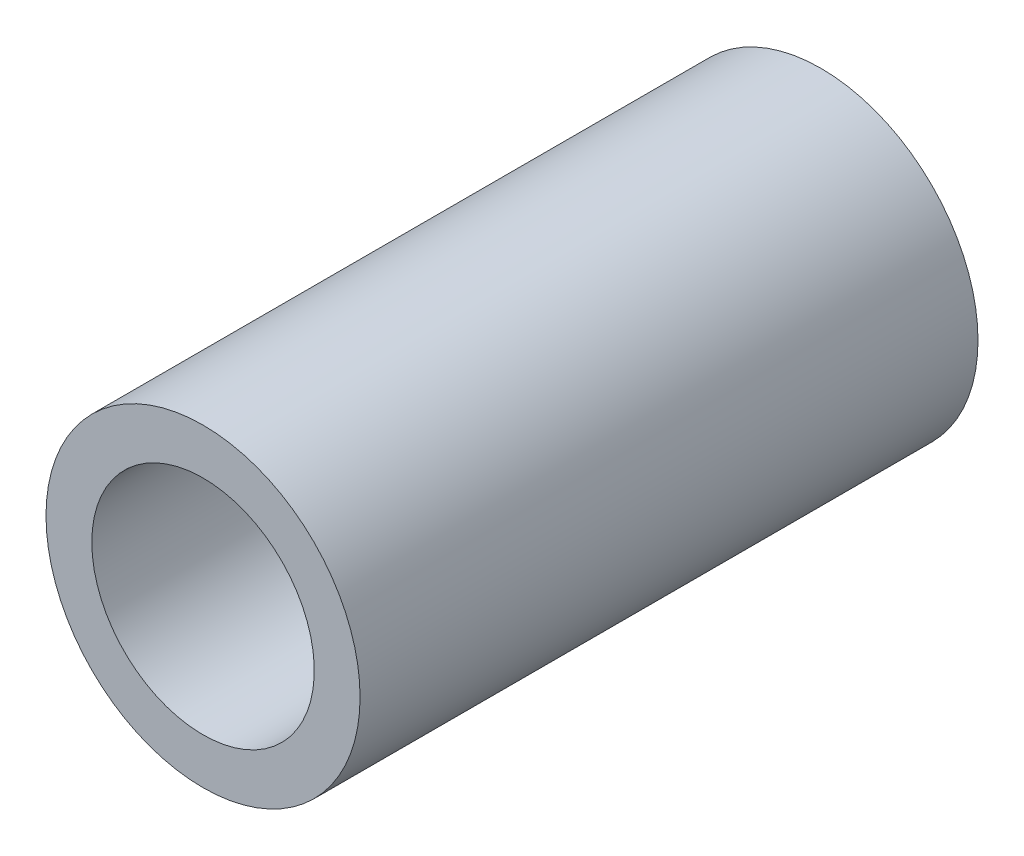
ISO-10303-21;
HEADER;
FILE_DESCRIPTION(('STEP AP214'),'2;1');
FILE_NAME('part.step','',(''),(''),'','','');
FILE_SCHEMA(('AUTOMOTIVE_DESIGN { 1 0 10303 214 1 1 1 1 }'));
ENDSEC;
DATA;
#1=APPLICATION_CONTEXT('core data for automotive mechanical design processes');
#2=APPLICATION_PROTOCOL_DEFINITION('international standard','automotive_design',2000,#1);
#3=PRODUCT_CONTEXT('',#1,'mechanical');
#4=PRODUCT('Part','Part','',(#3));
#5=PRODUCT_RELATED_PRODUCT_CATEGORY('part','',(#4));
#6=PRODUCT_DEFINITION_FORMATION('','',#4);
#7=PRODUCT_DEFINITION_CONTEXT('part definition',#1,'design');
#8=PRODUCT_DEFINITION('design','',#6,#7);
#9=PRODUCT_DEFINITION_SHAPE('','',#8);
#10=(LENGTH_UNIT() NAMED_UNIT(*) SI_UNIT(.MILLI.,.METRE.));
#11=(NAMED_UNIT(*) PLANE_ANGLE_UNIT() SI_UNIT($,.RADIAN.));
#12=(NAMED_UNIT(*) SI_UNIT($,.STERADIAN.) SOLID_ANGLE_UNIT());
#13=UNCERTAINTY_MEASURE_WITH_UNIT(LENGTH_MEASURE(1.E-05),#10,'distance_accuracy_value','');
#14=(GEOMETRIC_REPRESENTATION_CONTEXT(3) GLOBAL_UNCERTAINTY_ASSIGNED_CONTEXT((#13)) GLOBAL_UNIT_ASSIGNED_CONTEXT((#10,
#11,#12)) REPRESENTATION_CONTEXT('',''));
#15=CARTESIAN_POINT('',(0.,0.,0.));
#16=DIRECTION('',(0.,0.,1.));
#17=DIRECTION('',(1.,0.,0.));
#18=AXIS2_PLACEMENT_3D('',#15,#16,#17);
#19=CARTESIAN_POINT('',(0.,0.,23.61));
#20=DIRECTION('',(0.,0.,-1.));
#21=DIRECTION('',(-1.,0.,0.));
#22=AXIS2_PLACEMENT_3D('',#19,#20,#21);
#23=CYLINDRICAL_SURFACE('',#22,4.25);
#24=CARTESIAN_POINT('',(0.,0.,0.));
#25=DIRECTION('',(0.,0.,-1.));
#26=DIRECTION('',(-1.,0.,0.));
#27=AXIS2_PLACEMENT_3D('',#24,#25,#26);
#28=CIRCLE('',#27,4.25);
#29=CARTESIAN_POINT('',(-4.25,0.,0.));
#30=VERTEX_POINT('',#29);
#31=EDGE_CURVE('E26',#30,#30,#28,.T.);
#32=ORIENTED_EDGE('',*,*,#31,.T.);
#33=EDGE_LOOP('',(#32));
#34=FACE_BOUND('',#33,.T.);
#35=CARTESIAN_POINT('',(0.,0.,23.61));
#36=DIRECTION('',(0.,0.,-1.));
#37=DIRECTION('',(-1.,0.,0.));
#38=AXIS2_PLACEMENT_3D('',#35,#36,#37);
#39=CIRCLE('',#38,4.25);
#40=CARTESIAN_POINT('',(-4.25,0.,23.61));
#41=VERTEX_POINT('',#40);
#42=EDGE_CURVE('E17',#41,#41,#39,.T.);
#43=ORIENTED_EDGE('',*,*,#42,.F.);
#44=EDGE_LOOP('',(#43));
#45=FACE_BOUND('',#44,.T.);
#46=ADVANCED_FACE('F14',(#34,#45),#23,.F.);
#47=CARTESIAN_POINT('',(0.,0.,23.61));
#48=DIRECTION('',(0.,0.,1.));
#49=DIRECTION('',(1.,0.,0.));
#50=AXIS2_PLACEMENT_3D('',#47,#48,#49);
#51=PLANE('',#50);
#52=ORIENTED_EDGE('',*,*,#42,.T.);
#53=EDGE_LOOP('',(#52));
#54=FACE_BOUND('',#53,.T.);
#55=CARTESIAN_POINT('',(0.,0.,23.61));
#56=DIRECTION('',(0.,0.,-1.));
#57=DIRECTION('',(-1.,0.,0.));
#58=AXIS2_PLACEMENT_3D('',#55,#56,#57);
#59=CIRCLE('',#58,6.);
#60=CARTESIAN_POINT('',(-6.,0.,23.61));
#61=VERTEX_POINT('',#60);
#62=EDGE_CURVE('E21',#61,#61,#59,.T.);
#63=ORIENTED_EDGE('',*,*,#62,.F.);
#64=EDGE_LOOP('',(#63));
#65=FACE_BOUND('',#64,.T.);
#66=ADVANCED_FACE('F34',(#54,#65),#51,.T.);
#67=CARTESIAN_POINT('',(0.,0.,0.));
#68=DIRECTION('',(0.,0.,1.));
#69=DIRECTION('',(1.,0.,0.));
#70=AXIS2_PLACEMENT_3D('',#67,#68,#69);
#71=PLANE('',#70);
#72=ORIENTED_EDGE('',*,*,#31,.F.);
#73=EDGE_LOOP('',(#72));
#74=FACE_BOUND('',#73,.T.);
#75=CARTESIAN_POINT('',(0.,0.,0.));
#76=DIRECTION('',(0.,0.,-1.));
#77=DIRECTION('',(-1.,0.,0.));
#78=AXIS2_PLACEMENT_3D('',#75,#76,#77);
#79=CIRCLE('',#78,6.);
#80=CARTESIAN_POINT('',(-6.,0.,0.));
#81=VERTEX_POINT('',#80);
#82=EDGE_CURVE('E10',#81,#81,#79,.F.);
#83=ORIENTED_EDGE('',*,*,#82,.F.);
#84=EDGE_LOOP('',(#83));
#85=FACE_BOUND('',#84,.T.);
#86=ADVANCED_FACE('F42',(#74,#85),#71,.F.);
#87=CARTESIAN_POINT('',(0.,0.,23.61));
#88=DIRECTION('',(0.,0.,-1.));
#89=DIRECTION('',(-1.,0.,0.));
#90=AXIS2_PLACEMENT_3D('',#87,#88,#89);
#91=CYLINDRICAL_SURFACE('',#90,6.);
#92=ORIENTED_EDGE('',*,*,#82,.T.);
#93=EDGE_LOOP('',(#92));
#94=FACE_BOUND('',#93,.T.);
#95=ORIENTED_EDGE('',*,*,#62,.T.);
#96=EDGE_LOOP('',(#95));
#97=FACE_BOUND('',#96,.T.);
#98=ADVANCED_FACE('F43',(#94,#97),#91,.T.);
#99=CLOSED_SHELL('',(#46,#66,#86,#98));
#100=MANIFOLD_SOLID_BREP('B1',#99);
#101=ADVANCED_BREP_SHAPE_REPRESENTATION('',(#18,#100),#14);
#102=SHAPE_DEFINITION_REPRESENTATION(#9,#101);
ENDSEC;
END-ISO-10303-21;
